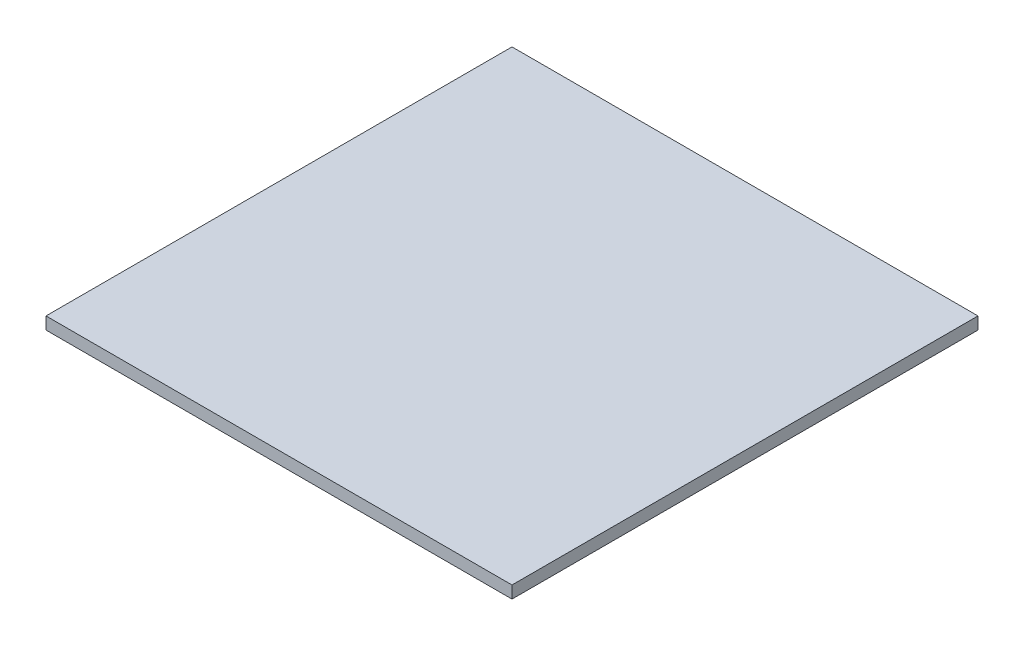
ISO-10303-21;
HEADER;
FILE_DESCRIPTION(('STEP AP214'),'2;1');
FILE_NAME('part.step','',(''),(''),'','','');
FILE_SCHEMA(('AUTOMOTIVE_DESIGN { 1 0 10303 214 1 1 1 1 }'));
ENDSEC;
DATA;
#1=APPLICATION_CONTEXT('core data for automotive mechanical design processes');
#2=APPLICATION_PROTOCOL_DEFINITION('international standard','automotive_design',2000,#1);
#3=PRODUCT_CONTEXT('',#1,'mechanical');
#4=PRODUCT('Part','Part','',(#3));
#5=PRODUCT_RELATED_PRODUCT_CATEGORY('part','',(#4));
#6=PRODUCT_DEFINITION_FORMATION('','',#4);
#7=PRODUCT_DEFINITION_CONTEXT('part definition',#1,'design');
#8=PRODUCT_DEFINITION('design','',#6,#7);
#9=PRODUCT_DEFINITION_SHAPE('','',#8);
#10=(LENGTH_UNIT() NAMED_UNIT(*) SI_UNIT(.MILLI.,.METRE.));
#11=(NAMED_UNIT(*) PLANE_ANGLE_UNIT() SI_UNIT($,.RADIAN.));
#12=(NAMED_UNIT(*) SI_UNIT($,.STERADIAN.) SOLID_ANGLE_UNIT());
#13=UNCERTAINTY_MEASURE_WITH_UNIT(LENGTH_MEASURE(1.E-05),#10,'distance_accuracy_value','');
#14=(GEOMETRIC_REPRESENTATION_CONTEXT(3) GLOBAL_UNCERTAINTY_ASSIGNED_CONTEXT((#13)) GLOBAL_UNIT_ASSIGNED_CONTEXT((#10,
#11,#12)) REPRESENTATION_CONTEXT('',''));
#15=CARTESIAN_POINT('',(0.,0.,0.));
#16=DIRECTION('',(0.,0.,1.));
#17=DIRECTION('',(1.,0.,0.));
#18=AXIS2_PLACEMENT_3D('',#15,#16,#17);
#19=CARTESIAN_POINT('',(0.,15.875,0.));
#20=DIRECTION('',(1.,0.,0.));
#21=DIRECTION('',(0.,0.,-1.));
#22=AXIS2_PLACEMENT_3D('',#19,#20,#21);
#23=PLANE('',#22);
#24=DIRECTION('',(0.,0.,1.));
#25=VECTOR('',#24,1.);
#26=CARTESIAN_POINT('',(0.,0.,0.));
#27=LINE('',#26,#25);
#28=CARTESIAN_POINT('',(0.,0.,-603.25));
#29=VERTEX_POINT('',#28);
#30=CARTESIAN_POINT('',(0.,0.,0.));
#31=VERTEX_POINT('',#30);
#32=EDGE_CURVE('E94',#29,#31,#27,.T.);
#33=ORIENTED_EDGE('',*,*,#32,.T.);
#34=DIRECTION('',(0.,-1.,0.));
#35=VECTOR('',#34,1.);
#36=CARTESIAN_POINT('',(0.,15.875,0.));
#37=LINE('',#36,#35);
#38=CARTESIAN_POINT('',(0.,15.875,0.));
#39=VERTEX_POINT('',#38);
#40=EDGE_CURVE('E11',#39,#31,#37,.T.);
#41=ORIENTED_EDGE('',*,*,#40,.F.);
#42=DIRECTION('',(0.,0.,1.));
#43=VECTOR('',#42,1.);
#44=CARTESIAN_POINT('',(0.,15.875,0.));
#45=LINE('',#44,#43);
#46=CARTESIAN_POINT('',(0.,15.875,-603.25));
#47=VERTEX_POINT('',#46);
#48=EDGE_CURVE('E82',#47,#39,#45,.T.);
#49=ORIENTED_EDGE('',*,*,#48,.F.);
#50=DIRECTION('',(0.,-1.,0.));
#51=VECTOR('',#50,1.);
#52=CARTESIAN_POINT('',(0.,15.875,-603.25));
#53=LINE('',#52,#51);
#54=EDGE_CURVE('E90',#47,#29,#53,.T.);
#55=ORIENTED_EDGE('',*,*,#54,.T.);
#56=EDGE_LOOP('',(#33,#41,#49,#55));
#57=FACE_BOUND('',#56,.T.);
#58=ADVANCED_FACE('F31',(#57),#23,.F.);
#59=CARTESIAN_POINT('',(0.,15.875,0.));
#60=DIRECTION('',(0.,0.,-1.));
#61=DIRECTION('',(-1.,0.,0.));
#62=AXIS2_PLACEMENT_3D('',#59,#60,#61);
#63=PLANE('',#62);
#64=DIRECTION('',(1.,0.,0.));
#65=VECTOR('',#64,1.);
#66=CARTESIAN_POINT('',(0.,0.,0.));
#67=LINE('',#66,#65);
#68=CARTESIAN_POINT('',(603.25,0.,0.));
#69=VERTEX_POINT('',#68);
#70=EDGE_CURVE('E86',#31,#69,#67,.T.);
#71=ORIENTED_EDGE('',*,*,#70,.T.);
#72=DIRECTION('',(0.,-1.,0.));
#73=VECTOR('',#72,1.);
#74=CARTESIAN_POINT('',(603.25,15.875,0.));
#75=LINE('',#74,#73);
#76=CARTESIAN_POINT('',(603.25,15.875,0.));
#77=VERTEX_POINT('',#76);
#78=EDGE_CURVE('E39',#77,#69,#75,.T.);
#79=ORIENTED_EDGE('',*,*,#78,.F.);
#80=DIRECTION('',(1.,0.,0.));
#81=VECTOR('',#80,1.);
#82=CARTESIAN_POINT('',(0.,15.875,0.));
#83=LINE('',#82,#81);
#84=EDGE_CURVE('E77',#39,#77,#83,.T.);
#85=ORIENTED_EDGE('',*,*,#84,.F.);
#86=ORIENTED_EDGE('',*,*,#40,.T.);
#87=EDGE_LOOP('',(#71,#79,#85,#86));
#88=FACE_BOUND('',#87,.T.);
#89=ADVANCED_FACE('F85',(#88),#63,.F.);
#90=CARTESIAN_POINT('',(603.25,15.875,0.));
#91=DIRECTION('',(-1.,0.,0.));
#92=DIRECTION('',(0.,0.,1.));
#93=AXIS2_PLACEMENT_3D('',#90,#91,#92);
#94=PLANE('',#93);
#95=DIRECTION('',(0.,0.,-1.));
#96=VECTOR('',#95,1.);
#97=CARTESIAN_POINT('',(603.25,0.,0.));
#98=LINE('',#97,#96);
#99=CARTESIAN_POINT('',(603.25,0.,-603.25));
#100=VERTEX_POINT('',#99);
#101=EDGE_CURVE('E64',#69,#100,#98,.T.);
#102=ORIENTED_EDGE('',*,*,#101,.T.);
#103=DIRECTION('',(0.,-1.,0.));
#104=VECTOR('',#103,1.);
#105=CARTESIAN_POINT('',(603.25,15.875,-603.25));
#106=LINE('',#105,#104);
#107=CARTESIAN_POINT('',(603.25,15.875,-603.25));
#108=VERTEX_POINT('',#107);
#109=EDGE_CURVE('E87',#108,#100,#106,.T.);
#110=ORIENTED_EDGE('',*,*,#109,.F.);
#111=DIRECTION('',(0.,0.,-1.));
#112=VECTOR('',#111,1.);
#113=CARTESIAN_POINT('',(603.25,15.875,0.));
#114=LINE('',#113,#112);
#115=EDGE_CURVE('E80',#77,#108,#114,.T.);
#116=ORIENTED_EDGE('',*,*,#115,.F.);
#117=ORIENTED_EDGE('',*,*,#78,.T.);
#118=EDGE_LOOP('',(#102,#110,#116,#117));
#119=FACE_BOUND('',#118,.T.);
#120=ADVANCED_FACE('F88',(#119),#94,.F.);
#121=CARTESIAN_POINT('',(0.,15.875,-603.25));
#122=DIRECTION('',(0.,0.,1.));
#123=DIRECTION('',(1.,0.,0.));
#124=AXIS2_PLACEMENT_3D('',#121,#122,#123);
#125=PLANE('',#124);
#126=DIRECTION('',(-1.,0.,0.));
#127=VECTOR('',#126,1.);
#128=CARTESIAN_POINT('',(0.,0.,-603.25));
#129=LINE('',#128,#127);
#130=EDGE_CURVE('E70',#100,#29,#129,.T.);
#131=ORIENTED_EDGE('',*,*,#130,.T.);
#132=ORIENTED_EDGE('',*,*,#54,.F.);
#133=DIRECTION('',(-1.,0.,0.));
#134=VECTOR('',#133,1.);
#135=CARTESIAN_POINT('',(0.,15.875,-603.25));
#136=LINE('',#135,#134);
#137=EDGE_CURVE('E47',#108,#47,#136,.T.);
#138=ORIENTED_EDGE('',*,*,#137,.F.);
#139=ORIENTED_EDGE('',*,*,#109,.T.);
#140=EDGE_LOOP('',(#131,#132,#138,#139));
#141=FACE_BOUND('',#140,.T.);
#142=ADVANCED_FACE('F101',(#141),#125,.F.);
#143=CARTESIAN_POINT('',(0.,15.875,-603.25));
#144=DIRECTION('',(0.,-1.,0.));
#145=DIRECTION('',(0.,0.,-1.));
#146=AXIS2_PLACEMENT_3D('',#143,#144,#145);
#147=PLANE('',#146);
#148=ORIENTED_EDGE('',*,*,#48,.T.);
#149=ORIENTED_EDGE('',*,*,#84,.T.);
#150=ORIENTED_EDGE('',*,*,#115,.T.);
#151=ORIENTED_EDGE('',*,*,#137,.T.);
#152=EDGE_LOOP('',(#148,#149,#150,#151));
#153=FACE_BOUND('',#152,.T.);
#154=ADVANCED_FACE('F78',(#153),#147,.F.);
#155=CARTESIAN_POINT('',(0.,0.,-603.25));
#156=DIRECTION('',(0.,-1.,0.));
#157=DIRECTION('',(0.,0.,-1.));
#158=AXIS2_PLACEMENT_3D('',#155,#156,#157);
#159=PLANE('',#158);
#160=ORIENTED_EDGE('',*,*,#32,.F.);
#161=ORIENTED_EDGE('',*,*,#130,.F.);
#162=ORIENTED_EDGE('',*,*,#101,.F.);
#163=ORIENTED_EDGE('',*,*,#70,.F.);
#164=EDGE_LOOP('',(#160,#161,#162,#163));
#165=FACE_BOUND('',#164,.T.);
#166=ADVANCED_FACE('F104',(#165),#159,.T.);
#167=CLOSED_SHELL('',(#58,#89,#120,#142,#154,#166));
#168=MANIFOLD_SOLID_BREP('B2',#167);
#169=ADVANCED_BREP_SHAPE_REPRESENTATION('',(#18,#168),#14);
#170=SHAPE_DEFINITION_REPRESENTATION(#9,#169);
ENDSEC;
END-ISO-10303-21;
